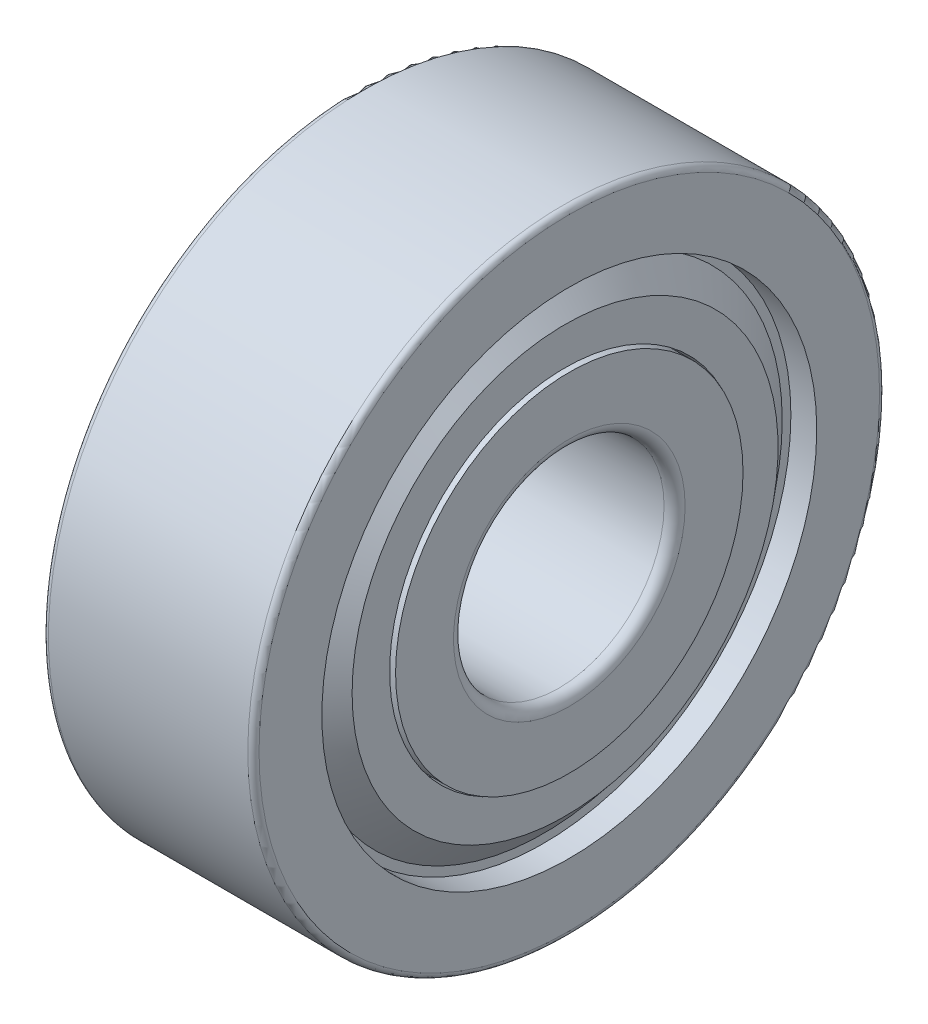
ISO-10303-21;
HEADER;
FILE_DESCRIPTION(('STEP AP214'),'2;1');
FILE_NAME('part.step','',(''),(''),'','','');
FILE_SCHEMA(('AUTOMOTIVE_DESIGN { 1 0 10303 214 1 1 1 1 }'));
ENDSEC;
DATA;
#1=APPLICATION_CONTEXT('core data for automotive mechanical design processes');
#2=APPLICATION_PROTOCOL_DEFINITION('international standard','automotive_design',2000,#1);
#3=PRODUCT_CONTEXT('',#1,'mechanical');
#4=PRODUCT('Part','Part','',(#3));
#5=PRODUCT_RELATED_PRODUCT_CATEGORY('part','',(#4));
#6=PRODUCT_DEFINITION_FORMATION('','',#4);
#7=PRODUCT_DEFINITION_CONTEXT('part definition',#1,'design');
#8=PRODUCT_DEFINITION('design','',#6,#7);
#9=PRODUCT_DEFINITION_SHAPE('','',#8);
#10=(LENGTH_UNIT() NAMED_UNIT(*) SI_UNIT(.MILLI.,.METRE.));
#11=(NAMED_UNIT(*) PLANE_ANGLE_UNIT() SI_UNIT($,.RADIAN.));
#12=(NAMED_UNIT(*) SI_UNIT($,.STERADIAN.) SOLID_ANGLE_UNIT());
#13=UNCERTAINTY_MEASURE_WITH_UNIT(LENGTH_MEASURE(1.E-05),#10,'distance_accuracy_value','');
#14=(GEOMETRIC_REPRESENTATION_CONTEXT(3) GLOBAL_UNCERTAINTY_ASSIGNED_CONTEXT((#13)) GLOBAL_UNIT_ASSIGNED_CONTEXT((#10,
#11,#12)) REPRESENTATION_CONTEXT('',''));
#15=CARTESIAN_POINT('',(0.,0.,0.));
#16=DIRECTION('',(0.,0.,1.));
#17=DIRECTION('',(1.,0.,0.));
#18=AXIS2_PLACEMENT_3D('',#15,#16,#17);
#19=CARTESIAN_POINT('',(0.,-9.525,0.));
#20=DIRECTION('',(1.,0.,0.));
#21=DIRECTION('',(0.,1.,0.));
#22=AXIS2_PLACEMENT_3D('',#19,#20,#21);
#23=SPHERICAL_SURFACE('',#22,2.38125);
#24=CARTESIAN_POINT('',(2.38125,-9.525,0.));
#25=VERTEX_POINT('',#24);
#26=VERTEX_LOOP('',#25);
#27=FACE_BOUND('',#26,.T.);
#28=CARTESIAN_POINT('',(-2.38125,-9.525,0.));
#29=VERTEX_POINT('',#28);
#30=VERTEX_LOOP('',#29);
#31=FACE_BOUND('',#30,.T.);
#32=ADVANCED_FACE('P0_F15',(#27,#31),#23,.T.);
#33=CLOSED_SHELL('',(#32));
#34=MANIFOLD_SOLID_BREP('P0_B1',#33);
#35=CARTESIAN_POINT('',(0.,0.,0.));
#36=DIRECTION('',(1.,0.,0.));
#37=DIRECTION('',(0.,0.,-1.));
#38=AXIS2_PLACEMENT_3D('',#35,#36,#37);
#39=TOROIDAL_SURFACE('',#38,9.525,2.38125);
#40=CARTESIAN_POINT('',(1.70055264454679,0.,0.));
#41=DIRECTION('',(1.,0.,0.));
#42=DIRECTION('',(0.,0.,-1.));
#43=AXIS2_PLACEMENT_3D('',#40,#41,#42);
#44=CIRCLE('',#43,11.191875);
#45=CARTESIAN_POINT('',(1.70055264454679,0.,-11.191875));
#46=VERTEX_POINT('',#45);
#47=EDGE_CURVE('P1_E197',#46,#46,#44,.T.);
#48=ORIENTED_EDGE('',*,*,#47,.T.);
#49=EDGE_LOOP('',(#48));
#50=FACE_BOUND('',#49,.T.);
#51=CARTESIAN_POINT('',(-1.70055264454679,0.,0.));
#52=DIRECTION('',(1.,0.,0.));
#53=DIRECTION('',(0.,0.,-1.));
#54=AXIS2_PLACEMENT_3D('',#51,#52,#53);
#55=CIRCLE('',#54,11.191875);
#56=CARTESIAN_POINT('',(-1.70055264454679,0.,-11.191875));
#57=VERTEX_POINT('',#56);
#58=EDGE_CURVE('P1_E201',#57,#57,#55,.F.);
#59=ORIENTED_EDGE('',*,*,#58,.T.);
#60=EDGE_LOOP('',(#59));
#61=FACE_BOUND('',#60,.T.);
#62=ADVANCED_FACE('P1_F14',(#50,#61),#39,.F.);
#63=CARTESIAN_POINT('',(-5.23875,0.,0.));
#64=DIRECTION('',(1.,0.,0.));
#65=DIRECTION('',(0.,0.,-1.));
#66=AXIS2_PLACEMENT_3D('',#63,#64,#65);
#67=CYLINDRICAL_SURFACE('',#66,11.191875);
#68=ORIENTED_EDGE('',*,*,#58,.F.);
#69=EDGE_LOOP('',(#68));
#70=FACE_BOUND('',#69,.T.);
#71=CARTESIAN_POINT('',(-3.35513474719232,0.,0.));
#72=DIRECTION('',(1.,0.,0.));
#73=DIRECTION('',(0.,0.,-1.));
#74=AXIS2_PLACEMENT_3D('',#71,#72,#73);
#75=CIRCLE('',#74,11.191875);
#76=CARTESIAN_POINT('',(-3.35513474719232,0.,-11.191875));
#77=VERTEX_POINT('',#76);
#78=EDGE_CURVE('P1_E18',#77,#77,#75,.T.);
#79=ORIENTED_EDGE('',*,*,#78,.F.);
#80=EDGE_LOOP('',(#79));
#81=FACE_BOUND('',#80,.T.);
#82=ADVANCED_FACE('P1_F133',(#70,#81),#67,.F.);
#83=CARTESIAN_POINT('',(-5.23875,0.,0.));
#84=DIRECTION('',(1.,0.,0.));
#85=DIRECTION('',(0.,0.,-1.));
#86=AXIS2_PLACEMENT_3D('',#83,#84,#85);
#87=CYLINDRICAL_SURFACE('',#86,11.191875);
#88=ORIENTED_EDGE('',*,*,#47,.F.);
#89=EDGE_LOOP('',(#88));
#90=FACE_BOUND('',#89,.T.);
#91=CARTESIAN_POINT('',(3.35513474719232,0.,0.));
#92=DIRECTION('',(1.,0.,0.));
#93=DIRECTION('',(0.,0.,-1.));
#94=AXIS2_PLACEMENT_3D('',#91,#92,#93);
#95=CIRCLE('',#94,11.191875);
#96=CARTESIAN_POINT('',(3.35513474719232,0.,-11.191875));
#97=VERTEX_POINT('',#96);
#98=EDGE_CURVE('P1_E192',#97,#97,#95,.T.);
#99=ORIENTED_EDGE('',*,*,#98,.T.);
#100=EDGE_LOOP('',(#99));
#101=FACE_BOUND('',#100,.T.);
#102=ADVANCED_FACE('P1_F130',(#90,#101),#87,.F.);
#103=CARTESIAN_POINT('',(-3.35513474719232,0.,0.));
#104=DIRECTION('',(1.,0.,0.));
#105=DIRECTION('',(0.,0.,-1.));
#106=AXIS2_PLACEMENT_3D('',#103,#104,#105);
#107=PLANE('',#106);
#108=CARTESIAN_POINT('',(-3.35513474719232,0.,0.));
#109=DIRECTION('',(1.,0.,0.));
#110=DIRECTION('',(0.,0.,-1.));
#111=AXIS2_PLACEMENT_3D('',#108,#109,#110);
#112=CIRCLE('',#111,7.93670625);
#113=CARTESIAN_POINT('',(-3.35513474719232,0.,-7.93670625));
#114=VERTEX_POINT('',#113);
#115=EDGE_CURVE('P1_E190',#114,#114,#112,.F.);
#116=ORIENTED_EDGE('',*,*,#115,.T.);
#117=EDGE_LOOP('',(#116));
#118=FACE_BOUND('',#117,.T.);
#119=ORIENTED_EDGE('',*,*,#78,.T.);
#120=EDGE_LOOP('',(#119));
#121=FACE_BOUND('',#120,.T.);
#122=ADVANCED_FACE('P1_F126',(#118,#121),#107,.T.);
#123=CARTESIAN_POINT('',(3.35513474719232,0.,0.));
#124=DIRECTION('',(1.,0.,0.));
#125=DIRECTION('',(0.,0.,-1.));
#126=AXIS2_PLACEMENT_3D('',#123,#124,#125);
#127=PLANE('',#126);
#128=CARTESIAN_POINT('',(3.35513474719232,0.,0.));
#129=DIRECTION('',(1.,0.,0.));
#130=DIRECTION('',(0.,0.,-1.));
#131=AXIS2_PLACEMENT_3D('',#128,#129,#130);
#132=CIRCLE('',#131,7.93670625);
#133=CARTESIAN_POINT('',(3.35513474719232,0.,-7.93670625));
#134=VERTEX_POINT('',#133);
#135=EDGE_CURVE('P1_E187',#134,#134,#132,.T.);
#136=ORIENTED_EDGE('',*,*,#135,.T.);
#137=EDGE_LOOP('',(#136));
#138=FACE_BOUND('',#137,.T.);
#139=ORIENTED_EDGE('',*,*,#98,.F.);
#140=EDGE_LOOP('',(#139));
#141=FACE_BOUND('',#140,.T.);
#142=ADVANCED_FACE('P1_F122',(#138,#141),#127,.F.);
#143=CARTESIAN_POINT('',(-5.0292,0.,0.));
#144=DIRECTION('',(1.,0.,0.));
#145=DIRECTION('',(0.,0.,-1.));
#146=AXIS2_PLACEMENT_3D('',#143,#144,#145);
#147=CYLINDRICAL_SURFACE('',#146,7.93670625);
#148=ORIENTED_EDGE('',*,*,#115,.F.);
#149=EDGE_LOOP('',(#148));
#150=FACE_BOUND('',#149,.T.);
#151=CARTESIAN_POINT('',(-4.572,0.,0.));
#152=DIRECTION('',(1.,0.,0.));
#153=DIRECTION('',(0.,0.,-1.));
#154=AXIS2_PLACEMENT_3D('',#151,#152,#153);
#155=CIRCLE('',#154,7.93670625);
#156=CARTESIAN_POINT('',(-4.572,0.,-7.93670625));
#157=VERTEX_POINT('',#156);
#158=EDGE_CURVE('P1_E184',#157,#157,#155,.F.);
#159=ORIENTED_EDGE('',*,*,#158,.T.);
#160=EDGE_LOOP('',(#159));
#161=FACE_BOUND('',#160,.T.);
#162=ADVANCED_FACE('P1_F118',(#150,#161),#147,.F.);
#163=CARTESIAN_POINT('',(-5.0292,0.,0.));
#164=DIRECTION('',(1.,0.,0.));
#165=DIRECTION('',(0.,0.,-1.));
#166=AXIS2_PLACEMENT_3D('',#163,#164,#165);
#167=CYLINDRICAL_SURFACE('',#166,7.93670625);
#168=CARTESIAN_POINT('',(4.572,0.,0.));
#169=DIRECTION('',(1.,0.,0.));
#170=DIRECTION('',(0.,0.,-1.));
#171=AXIS2_PLACEMENT_3D('',#168,#169,#170);
#172=CIRCLE('',#171,7.93670625);
#173=CARTESIAN_POINT('',(4.572,0.,-7.93670625));
#174=VERTEX_POINT('',#173);
#175=EDGE_CURVE('P1_E181',#174,#174,#172,.F.);
#176=ORIENTED_EDGE('',*,*,#175,.F.);
#177=EDGE_LOOP('',(#176));
#178=FACE_BOUND('',#177,.T.);
#179=ORIENTED_EDGE('',*,*,#135,.F.);
#180=EDGE_LOOP('',(#179));
#181=FACE_BOUND('',#180,.T.);
#182=ADVANCED_FACE('P1_F114',(#178,#181),#167,.F.);
#183=CARTESIAN_POINT('',(-4.572,0.,0.));
#184=DIRECTION('',(1.,0.,0.));
#185=DIRECTION('',(0.,0.,-1.));
#186=AXIS2_PLACEMENT_3D('',#183,#184,#185);
#187=PLANE('',#186);
#188=ORIENTED_EDGE('',*,*,#158,.F.);
#189=EDGE_LOOP('',(#188));
#190=FACE_BOUND('',#189,.T.);
#191=CARTESIAN_POINT('',(-4.57200001572153,0.,0.));
#192=DIRECTION('',(1.,0.,0.));
#193=DIRECTION('',(0.,0.,-1.));
#194=AXIS2_PLACEMENT_3D('',#191,#192,#193);
#195=CIRCLE('',#194,9.63374217569193);
#196=CARTESIAN_POINT('',(-4.57200001572153,0.,-9.63374217569193));
#197=VERTEX_POINT('',#196);
#198=EDGE_CURVE('P1_E178',#197,#197,#195,.T.);
#199=ORIENTED_EDGE('',*,*,#198,.F.);
#200=EDGE_LOOP('',(#199));
#201=FACE_BOUND('',#200,.T.);
#202=ADVANCED_FACE('P1_F110',(#190,#201),#187,.F.);
#203=CARTESIAN_POINT('',(4.572,0.,0.));
#204=DIRECTION('',(1.,0.,0.));
#205=DIRECTION('',(0.,0.,-1.));
#206=AXIS2_PLACEMENT_3D('',#203,#204,#205);
#207=PLANE('',#206);
#208=ORIENTED_EDGE('',*,*,#175,.T.);
#209=EDGE_LOOP('',(#208));
#210=FACE_BOUND('',#209,.T.);
#211=CARTESIAN_POINT('',(4.57200001572153,0.,0.));
#212=DIRECTION('',(-1.,0.,0.));
#213=DIRECTION('',(0.,0.,1.));
#214=AXIS2_PLACEMENT_3D('',#211,#212,#213);
#215=CIRCLE('',#214,9.63374217569193);
#216=CARTESIAN_POINT('',(4.57200001572153,0.,9.63374217569193));
#217=VERTEX_POINT('',#216);
#218=EDGE_CURVE('P1_E175',#217,#217,#215,.T.);
#219=ORIENTED_EDGE('',*,*,#218,.F.);
#220=EDGE_LOOP('',(#219));
#221=FACE_BOUND('',#220,.T.);
#222=ADVANCED_FACE('P1_F106',(#210,#221),#207,.T.);
#223=CARTESIAN_POINT('',(-3.5932597617508,0.,0.));
#224=DIRECTION('',(1.,0.,0.));
#225=DIRECTION('',(0.,0.,-1.));
#226=AXIS2_PLACEMENT_3D('',#223,#224,#225);
#227=CONICAL_SURFACE('',#226,10.800159387216,0.872664625);
#228=ORIENTED_EDGE('',*,*,#198,.T.);
#229=EDGE_LOOP('',(#228));
#230=FACE_BOUND('',#229,.T.);
#231=CARTESIAN_POINT('',(-3.5932597617508,0.,0.));
#232=DIRECTION('',(1.,0.,0.));
#233=DIRECTION('',(0.,0.,-1.));
#234=AXIS2_PLACEMENT_3D('',#231,#232,#233);
#235=CIRCLE('',#234,10.800159387216);
#236=CARTESIAN_POINT('',(-3.5932597617508,0.,-10.800159387216));
#237=VERTEX_POINT('',#236);
#238=EDGE_CURVE('P1_E172',#237,#237,#235,.F.);
#239=ORIENTED_EDGE('',*,*,#238,.T.);
#240=EDGE_LOOP('',(#239));
#241=FACE_BOUND('',#240,.T.);
#242=ADVANCED_FACE('P1_F102',(#230,#241),#227,.T.);
#243=CARTESIAN_POINT('',(3.5932597617508,0.,0.));
#244=DIRECTION('',(-1.,0.,0.));
#245=DIRECTION('',(0.,0.,1.));
#246=AXIS2_PLACEMENT_3D('',#243,#244,#245);
#247=CONICAL_SURFACE('',#246,10.800159387216,0.872664625);
#248=CARTESIAN_POINT('',(3.5932597617508,0.,0.));
#249=DIRECTION('',(-1.,0.,0.));
#250=DIRECTION('',(0.,0.,1.));
#251=AXIS2_PLACEMENT_3D('',#248,#249,#250);
#252=CIRCLE('',#251,10.800159387216);
#253=CARTESIAN_POINT('',(3.5932597617508,0.,10.800159387216));
#254=VERTEX_POINT('',#253);
#255=EDGE_CURVE('P1_E169',#254,#254,#252,.T.);
#256=ORIENTED_EDGE('',*,*,#255,.F.);
#257=EDGE_LOOP('',(#256));
#258=FACE_BOUND('',#257,.T.);
#259=ORIENTED_EDGE('',*,*,#218,.T.);
#260=EDGE_LOOP('',(#259));
#261=FACE_BOUND('',#260,.T.);
#262=ADVANCED_FACE('P1_F98',(#258,#261),#247,.T.);
#263=CARTESIAN_POINT('',(-3.59325974719232,0.,0.));
#264=DIRECTION('',(1.,0.,0.));
#265=DIRECTION('',(0.,0.,-1.));
#266=AXIS2_PLACEMENT_3D('',#263,#264,#265);
#267=PLANE('',#266);
#268=ORIENTED_EDGE('',*,*,#238,.F.);
#269=EDGE_LOOP('',(#268));
#270=FACE_BOUND('',#269,.T.);
#271=CARTESIAN_POINT('',(-3.59325974719232,0.,0.));
#272=DIRECTION('',(1.,0.,0.));
#273=DIRECTION('',(0.,0.,-1.));
#274=AXIS2_PLACEMENT_3D('',#271,#272,#273);
#275=CIRCLE('',#274,11.191875);
#276=CARTESIAN_POINT('',(-3.59325974719232,0.,-11.191875));
#277=VERTEX_POINT('',#276);
#278=EDGE_CURVE('P1_E166',#277,#277,#275,.F.);
#279=ORIENTED_EDGE('',*,*,#278,.T.);
#280=EDGE_LOOP('',(#279));
#281=FACE_BOUND('',#280,.T.);
#282=ADVANCED_FACE('P1_F94',(#270,#281),#267,.F.);
#283=CARTESIAN_POINT('',(3.59325974719232,0.,0.));
#284=DIRECTION('',(1.,0.,0.));
#285=DIRECTION('',(0.,0.,-1.));
#286=AXIS2_PLACEMENT_3D('',#283,#284,#285);
#287=PLANE('',#286);
#288=ORIENTED_EDGE('',*,*,#255,.T.);
#289=EDGE_LOOP('',(#288));
#290=FACE_BOUND('',#289,.T.);
#291=CARTESIAN_POINT('',(3.59325974719232,0.,0.));
#292=DIRECTION('',(1.,0.,0.));
#293=DIRECTION('',(0.,0.,-1.));
#294=AXIS2_PLACEMENT_3D('',#291,#292,#293);
#295=CIRCLE('',#294,11.191875);
#296=CARTESIAN_POINT('',(3.59325974719232,0.,-11.191875));
#297=VERTEX_POINT('',#296);
#298=EDGE_CURVE('P1_E159',#297,#297,#295,.T.);
#299=ORIENTED_EDGE('',*,*,#298,.T.);
#300=EDGE_LOOP('',(#299));
#301=FACE_BOUND('',#300,.T.);
#302=ADVANCED_FACE('P1_F90',(#290,#301),#287,.T.);
#303=CARTESIAN_POINT('',(-5.23875,0.,0.));
#304=DIRECTION('',(1.,0.,0.));
#305=DIRECTION('',(0.,0.,-1.));
#306=AXIS2_PLACEMENT_3D('',#303,#304,#305);
#307=CYLINDRICAL_SURFACE('',#306,11.191875);
#308=CARTESIAN_POINT('',(-4.7625,0.,0.));
#309=DIRECTION('',(1.,0.,0.));
#310=DIRECTION('',(0.,0.,-1.));
#311=AXIS2_PLACEMENT_3D('',#308,#309,#310);
#312=CIRCLE('',#311,11.191875);
#313=CARTESIAN_POINT('',(-4.7625,0.,-11.191875));
#314=VERTEX_POINT('',#313);
#315=EDGE_CURVE('P1_E154',#314,#314,#312,.F.);
#316=ORIENTED_EDGE('',*,*,#315,.T.);
#317=EDGE_LOOP('',(#316));
#318=FACE_BOUND('',#317,.T.);
#319=ORIENTED_EDGE('',*,*,#278,.F.);
#320=EDGE_LOOP('',(#319));
#321=FACE_BOUND('',#320,.T.);
#322=ADVANCED_FACE('P1_F86',(#318,#321),#307,.F.);
#323=CARTESIAN_POINT('',(-5.23875,0.,0.));
#324=DIRECTION('',(1.,0.,0.));
#325=DIRECTION('',(0.,0.,-1.));
#326=AXIS2_PLACEMENT_3D('',#323,#324,#325);
#327=CYLINDRICAL_SURFACE('',#326,11.191875);
#328=CARTESIAN_POINT('',(4.7625,0.,0.));
#329=DIRECTION('',(1.,0.,0.));
#330=DIRECTION('',(0.,0.,-1.));
#331=AXIS2_PLACEMENT_3D('',#328,#329,#330);
#332=CIRCLE('',#331,11.191875);
#333=CARTESIAN_POINT('',(4.7625,0.,-11.191875));
#334=VERTEX_POINT('',#333);
#335=EDGE_CURVE('P1_E152',#334,#334,#332,.F.);
#336=ORIENTED_EDGE('',*,*,#335,.F.);
#337=EDGE_LOOP('',(#336));
#338=FACE_BOUND('',#337,.T.);
#339=ORIENTED_EDGE('',*,*,#298,.F.);
#340=EDGE_LOOP('',(#339));
#341=FACE_BOUND('',#340,.T.);
#342=ADVANCED_FACE('P1_F81',(#338,#341),#327,.F.);
#343=CARTESIAN_POINT('',(-4.7625,0.,0.));
#344=DIRECTION('',(1.,0.,0.));
#345=DIRECTION('',(0.,0.,-1.));
#346=AXIS2_PLACEMENT_3D('',#343,#344,#345);
#347=PLANE('',#346);
#348=ORIENTED_EDGE('',*,*,#315,.F.);
#349=EDGE_LOOP('',(#348));
#350=FACE_BOUND('',#349,.T.);
#351=CARTESIAN_POINT('',(-4.7625,0.,0.));
#352=DIRECTION('',(1.,0.,0.));
#353=DIRECTION('',(0.,0.,1.));
#354=AXIS2_PLACEMENT_3D('',#351,#352,#353);
#355=CIRCLE('',#354,14.0335);
#356=CARTESIAN_POINT('',(-4.7625,0.,14.0335));
#357=VERTEX_POINT('',#356);
#358=EDGE_CURVE('P1_E65',#357,#357,#355,.T.);
#359=ORIENTED_EDGE('',*,*,#358,.F.);
#360=EDGE_LOOP('',(#359));
#361=FACE_BOUND('',#360,.T.);
#362=ADVANCED_FACE('P1_F71',(#350,#361),#347,.F.);
#363=CARTESIAN_POINT('',(4.7625,0.,0.));
#364=DIRECTION('',(1.,0.,0.));
#365=DIRECTION('',(0.,0.,-1.));
#366=AXIS2_PLACEMENT_3D('',#363,#364,#365);
#367=PLANE('',#366);
#368=ORIENTED_EDGE('',*,*,#335,.T.);
#369=EDGE_LOOP('',(#368));
#370=FACE_BOUND('',#369,.T.);
#371=CARTESIAN_POINT('',(4.7625,0.,0.));
#372=DIRECTION('',(-1.,0.,0.));
#373=DIRECTION('',(0.,0.,1.));
#374=AXIS2_PLACEMENT_3D('',#371,#372,#373);
#375=CIRCLE('',#374,14.0335);
#376=CARTESIAN_POINT('',(4.7625,0.,14.0335));
#377=VERTEX_POINT('',#376);
#378=EDGE_CURVE('P1_E27',#377,#377,#375,.T.);
#379=ORIENTED_EDGE('',*,*,#378,.F.);
#380=EDGE_LOOP('',(#379));
#381=FACE_BOUND('',#380,.T.);
#382=ADVANCED_FACE('P1_F80',(#370,#381),#367,.T.);
#383=CARTESIAN_POINT('',(-4.5085,0.,0.));
#384=DIRECTION('',(1.,0.,0.));
#385=DIRECTION('',(0.,0.,-1.));
#386=AXIS2_PLACEMENT_3D('',#383,#384,#385);
#387=TOROIDAL_SURFACE('',#386,14.0335,0.254);
#388=CARTESIAN_POINT('',(-4.5085,0.,0.));
#389=DIRECTION('',(1.,0.,0.));
#390=DIRECTION('',(0.,0.,-1.));
#391=AXIS2_PLACEMENT_3D('',#388,#389,#390);
#392=CIRCLE('',#391,14.2875);
#393=CARTESIAN_POINT('',(-4.5085,0.,-14.2875));
#394=VERTEX_POINT('',#393);
#395=EDGE_CURVE('P1_E22',#394,#394,#392,.T.);
#396=ORIENTED_EDGE('',*,*,#395,.F.);
#397=EDGE_LOOP('',(#396));
#398=FACE_BOUND('',#397,.T.);
#399=ORIENTED_EDGE('',*,*,#358,.T.);
#400=EDGE_LOOP('',(#399));
#401=FACE_BOUND('',#400,.T.);
#402=ADVANCED_FACE('P1_F45',(#398,#401),#387,.T.);
#403=CARTESIAN_POINT('',(4.5085,0.,0.));
#404=DIRECTION('',(-1.,0.,0.));
#405=DIRECTION('',(0.,0.,1.));
#406=AXIS2_PLACEMENT_3D('',#403,#404,#405);
#407=TOROIDAL_SURFACE('',#406,14.0335,0.254);
#408=CARTESIAN_POINT('',(4.5085,0.,0.));
#409=DIRECTION('',(1.,0.,0.));
#410=DIRECTION('',(0.,0.,-1.));
#411=AXIS2_PLACEMENT_3D('',#408,#409,#410);
#412=CIRCLE('',#411,14.2875);
#413=CARTESIAN_POINT('',(4.5085,0.,-14.2875));
#414=VERTEX_POINT('',#413);
#415=EDGE_CURVE('P1_E10',#414,#414,#412,.F.);
#416=ORIENTED_EDGE('',*,*,#415,.F.);
#417=EDGE_LOOP('',(#416));
#418=FACE_BOUND('',#417,.T.);
#419=ORIENTED_EDGE('',*,*,#378,.T.);
#420=EDGE_LOOP('',(#419));
#421=FACE_BOUND('',#420,.T.);
#422=ADVANCED_FACE('P1_F39',(#418,#421),#407,.T.);
#423=CARTESIAN_POINT('',(-5.23875,0.,0.));
#424=DIRECTION('',(1.,0.,0.));
#425=DIRECTION('',(0.,0.,-1.));
#426=AXIS2_PLACEMENT_3D('',#423,#424,#425);
#427=CYLINDRICAL_SURFACE('',#426,14.2875);
#428=ORIENTED_EDGE('',*,*,#415,.T.);
#429=EDGE_LOOP('',(#428));
#430=FACE_BOUND('',#429,.T.);
#431=ORIENTED_EDGE('',*,*,#395,.T.);
#432=EDGE_LOOP('',(#431));
#433=FACE_BOUND('',#432,.T.);
#434=ADVANCED_FACE('P1_F44',(#430,#433),#427,.T.);
#435=CLOSED_SHELL('',(#62,#82,#102,#122,#142,#162,#182,#202,#222,#242,#262,#282,#302,#322,#342,
#362,#382,#402,#422,#434));
#436=MANIFOLD_SOLID_BREP('P1_B1',#435);
#437=CARTESIAN_POINT('',(0.,9.525,0.));
#438=DIRECTION('',(1.,0.,0.));
#439=DIRECTION('',(0.,1.,0.));
#440=AXIS2_PLACEMENT_3D('',#437,#438,#439);
#441=SPHERICAL_SURFACE('',#440,2.38125);
#442=CARTESIAN_POINT('',(2.38125,9.525,0.));
#443=VERTEX_POINT('',#442);
#444=VERTEX_LOOP('',#443);
#445=FACE_BOUND('',#444,.T.);
#446=CARTESIAN_POINT('',(-2.38125,9.525,0.));
#447=VERTEX_POINT('',#446);
#448=VERTEX_LOOP('',#447);
#449=FACE_BOUND('',#448,.T.);
#450=ADVANCED_FACE('P2_F15',(#445,#449),#441,.T.);
#451=CLOSED_SHELL('',(#450));
#452=MANIFOLD_SOLID_BREP('P2_B1',#451);
#453=CARTESIAN_POINT('',(0.,-6.735192090803,6.735192090803));
#454=DIRECTION('',(1.,0.,0.));
#455=DIRECTION('',(0.,1.,0.));
#456=AXIS2_PLACEMENT_3D('',#453,#454,#455);
#457=SPHERICAL_SURFACE('',#456,2.38125);
#458=CARTESIAN_POINT('',(2.38125,-6.735192090803,6.735192090803));
#459=VERTEX_POINT('',#458);
#460=VERTEX_LOOP('',#459);
#461=FACE_BOUND('',#460,.T.);
#462=CARTESIAN_POINT('',(-2.38125,-6.735192090803,6.735192090803));
#463=VERTEX_POINT('',#462);
#464=VERTEX_LOOP('',#463);
#465=FACE_BOUND('',#464,.T.);
#466=ADVANCED_FACE('P3_F15',(#461,#465),#457,.T.);
#467=CLOSED_SHELL('',(#466));
#468=MANIFOLD_SOLID_BREP('P3_B1',#467);
#469=CARTESIAN_POINT('',(0.,0.,-9.525));
#470=DIRECTION('',(1.,0.,0.));
#471=DIRECTION('',(0.,1.,0.));
#472=AXIS2_PLACEMENT_3D('',#469,#470,#471);
#473=SPHERICAL_SURFACE('',#472,2.38125);
#474=CARTESIAN_POINT('',(2.38125,0.,-9.525));
#475=VERTEX_POINT('',#474);
#476=VERTEX_LOOP('',#475);
#477=FACE_BOUND('',#476,.T.);
#478=CARTESIAN_POINT('',(-2.38125,0.,-9.525));
#479=VERTEX_POINT('',#478);
#480=VERTEX_LOOP('',#479);
#481=FACE_BOUND('',#480,.T.);
#482=ADVANCED_FACE('P4_F15',(#477,#481),#473,.T.);
#483=CLOSED_SHELL('',(#482));
#484=MANIFOLD_SOLID_BREP('P4_B1',#483);
#485=CARTESIAN_POINT('',(0.,0.,9.525));
#486=DIRECTION('',(1.,0.,0.));
#487=DIRECTION('',(0.,1.,0.));
#488=AXIS2_PLACEMENT_3D('',#485,#486,#487);
#489=SPHERICAL_SURFACE('',#488,2.38125);
#490=CARTESIAN_POINT('',(2.38125,0.,9.525));
#491=VERTEX_POINT('',#490);
#492=VERTEX_LOOP('',#491);
#493=FACE_BOUND('',#492,.T.);
#494=CARTESIAN_POINT('',(-2.38125,0.,9.525));
#495=VERTEX_POINT('',#494);
#496=VERTEX_LOOP('',#495);
#497=FACE_BOUND('',#496,.T.);
#498=ADVANCED_FACE('P5_F15',(#493,#497),#489,.T.);
#499=CLOSED_SHELL('',(#498));
#500=MANIFOLD_SOLID_BREP('P5_B1',#499);
#501=CARTESIAN_POINT('',(0.,-6.735192090803,-6.735192090803));
#502=DIRECTION('',(1.,0.,0.));
#503=DIRECTION('',(0.,1.,0.));
#504=AXIS2_PLACEMENT_3D('',#501,#502,#503);
#505=SPHERICAL_SURFACE('',#504,2.38125);
#506=CARTESIAN_POINT('',(2.38125,-6.735192090803,-6.735192090803));
#507=VERTEX_POINT('',#506);
#508=VERTEX_LOOP('',#507);
#509=FACE_BOUND('',#508,.T.);
#510=CARTESIAN_POINT('',(-2.38125,-6.735192090803,-6.735192090803));
#511=VERTEX_POINT('',#510);
#512=VERTEX_LOOP('',#511);
#513=FACE_BOUND('',#512,.T.);
#514=ADVANCED_FACE('P6_F15',(#509,#513),#505,.T.);
#515=CLOSED_SHELL('',(#514));
#516=MANIFOLD_SOLID_BREP('P6_B1',#515);
#517=CARTESIAN_POINT('',(0.,6.735192090803,-6.735192090803));
#518=DIRECTION('',(1.,0.,0.));
#519=DIRECTION('',(0.,1.,0.));
#520=AXIS2_PLACEMENT_3D('',#517,#518,#519);
#521=SPHERICAL_SURFACE('',#520,2.38125);
#522=CARTESIAN_POINT('',(2.38125,6.735192090803,-6.735192090803));
#523=VERTEX_POINT('',#522);
#524=VERTEX_LOOP('',#523);
#525=FACE_BOUND('',#524,.T.);
#526=CARTESIAN_POINT('',(-2.38125,6.735192090803,-6.735192090803));
#527=VERTEX_POINT('',#526);
#528=VERTEX_LOOP('',#527);
#529=FACE_BOUND('',#528,.T.);
#530=ADVANCED_FACE('P7_F15',(#525,#529),#521,.T.);
#531=CLOSED_SHELL('',(#530));
#532=MANIFOLD_SOLID_BREP('P7_B1',#531);
#533=CARTESIAN_POINT('',(0.,0.,0.));
#534=DIRECTION('',(1.,0.,0.));
#535=DIRECTION('',(0.,0.,-1.));
#536=AXIS2_PLACEMENT_3D('',#533,#534,#535);
#537=TOROIDAL_SURFACE('',#536,9.525,2.38125);
#538=CARTESIAN_POINT('',(-1.70055264454679,0.,0.));
#539=DIRECTION('',(1.,0.,0.));
#540=DIRECTION('',(0.,0.,-1.));
#541=AXIS2_PLACEMENT_3D('',#538,#539,#540);
#542=CIRCLE('',#541,7.858125);
#543=CARTESIAN_POINT('',(-1.70055264454679,0.,-7.858125));
#544=VERTEX_POINT('',#543);
#545=EDGE_CURVE('P8_E117',#544,#544,#542,.F.);
#546=ORIENTED_EDGE('',*,*,#545,.F.);
#547=EDGE_LOOP('',(#546));
#548=FACE_BOUND('',#547,.T.);
#549=CARTESIAN_POINT('',(1.70055264454679,0.,0.));
#550=DIRECTION('',(1.,0.,0.));
#551=DIRECTION('',(0.,0.,-1.));
#552=AXIS2_PLACEMENT_3D('',#549,#550,#551);
#553=CIRCLE('',#552,7.858125);
#554=CARTESIAN_POINT('',(1.70055264454679,0.,-7.858125));
#555=VERTEX_POINT('',#554);
#556=EDGE_CURVE('P8_E112',#555,#555,#553,.T.);
#557=ORIENTED_EDGE('',*,*,#556,.F.);
#558=EDGE_LOOP('',(#557));
#559=FACE_BOUND('',#558,.T.);
#560=ADVANCED_FACE('P8_F14',(#548,#559),#537,.F.);
#561=CARTESIAN_POINT('',(-5.23875,0.,0.));
#562=DIRECTION('',(1.,0.,0.));
#563=DIRECTION('',(0.,0.,-1.));
#564=AXIS2_PLACEMENT_3D('',#561,#562,#563);
#565=CYLINDRICAL_SURFACE('',#564,7.858125);
#566=ORIENTED_EDGE('',*,*,#545,.T.);
#567=EDGE_LOOP('',(#566));
#568=FACE_BOUND('',#567,.T.);
#569=CARTESIAN_POINT('',(-4.7625,0.,0.));
#570=DIRECTION('',(1.,0.,0.));
#571=DIRECTION('',(0.,0.,-1.));
#572=AXIS2_PLACEMENT_3D('',#569,#570,#571);
#573=CIRCLE('',#572,7.858125);
#574=CARTESIAN_POINT('',(-4.7625,0.,-7.858125));
#575=VERTEX_POINT('',#574);
#576=EDGE_CURVE('P8_E18',#575,#575,#573,.T.);
#577=ORIENTED_EDGE('',*,*,#576,.T.);
#578=EDGE_LOOP('',(#577));
#579=FACE_BOUND('',#578,.T.);
#580=ADVANCED_FACE('P8_F83',(#568,#579),#565,.T.);
#581=CARTESIAN_POINT('',(-5.23875,0.,0.));
#582=DIRECTION('',(1.,0.,0.));
#583=DIRECTION('',(0.,0.,-1.));
#584=AXIS2_PLACEMENT_3D('',#581,#582,#583);
#585=CYLINDRICAL_SURFACE('',#584,7.858125);
#586=CARTESIAN_POINT('',(4.7625,0.,0.));
#587=DIRECTION('',(1.,0.,0.));
#588=DIRECTION('',(0.,0.,-1.));
#589=AXIS2_PLACEMENT_3D('',#586,#587,#588);
#590=CIRCLE('',#589,7.858125);
#591=CARTESIAN_POINT('',(4.7625,0.,-7.858125));
#592=VERTEX_POINT('',#591);
#593=EDGE_CURVE('P8_E107',#592,#592,#590,.T.);
#594=ORIENTED_EDGE('',*,*,#593,.F.);
#595=EDGE_LOOP('',(#594));
#596=FACE_BOUND('',#595,.T.);
#597=ORIENTED_EDGE('',*,*,#556,.T.);
#598=EDGE_LOOP('',(#597));
#599=FACE_BOUND('',#598,.T.);
#600=ADVANCED_FACE('P8_F80',(#596,#599),#585,.T.);
#601=CARTESIAN_POINT('',(-4.7625,0.,0.));
#602=DIRECTION('',(1.,0.,0.));
#603=DIRECTION('',(0.,0.,-1.));
#604=AXIS2_PLACEMENT_3D('',#601,#602,#603);
#605=PLANE('',#604);
#606=CARTESIAN_POINT('',(-4.7625,0.,0.));
#607=DIRECTION('',(-1.,0.,0.));
#608=DIRECTION('',(0.,-1.,0.));
#609=AXIS2_PLACEMENT_3D('',#606,#607,#608);
#610=CIRCLE('',#609,5.23875);
#611=CARTESIAN_POINT('',(-4.7625,-5.23875,0.));
#612=VERTEX_POINT('',#611);
#613=EDGE_CURVE('P8_E64',#612,#612,#610,.T.);
#614=ORIENTED_EDGE('',*,*,#613,.F.);
#615=EDGE_LOOP('',(#614));
#616=FACE_BOUND('',#615,.T.);
#617=ORIENTED_EDGE('',*,*,#576,.F.);
#618=EDGE_LOOP('',(#617));
#619=FACE_BOUND('',#618,.T.);
#620=ADVANCED_FACE('P8_F70',(#616,#619),#605,.F.);
#621=CARTESIAN_POINT('',(4.7625,0.,0.));
#622=DIRECTION('',(1.,0.,0.));
#623=DIRECTION('',(0.,0.,-1.));
#624=AXIS2_PLACEMENT_3D('',#621,#622,#623);
#625=PLANE('',#624);
#626=CARTESIAN_POINT('',(4.7625,0.,0.));
#627=DIRECTION('',(1.,0.,0.));
#628=DIRECTION('',(0.,-1.,0.));
#629=AXIS2_PLACEMENT_3D('',#626,#627,#628);
#630=CIRCLE('',#629,5.23875);
#631=CARTESIAN_POINT('',(4.7625,-5.23875,0.));
#632=VERTEX_POINT('',#631);
#633=EDGE_CURVE('P8_E27',#632,#632,#630,.T.);
#634=ORIENTED_EDGE('',*,*,#633,.F.);
#635=EDGE_LOOP('',(#634));
#636=FACE_BOUND('',#635,.T.);
#637=ORIENTED_EDGE('',*,*,#593,.T.);
#638=EDGE_LOOP('',(#637));
#639=FACE_BOUND('',#638,.T.);
#640=ADVANCED_FACE('P8_F79',(#636,#639),#625,.T.);
#641=CARTESIAN_POINT('',(-4.28625,0.,0.));
#642=DIRECTION('',(1.,0.,0.));
#643=DIRECTION('',(0.,0.,-1.));
#644=AXIS2_PLACEMENT_3D('',#641,#642,#643);
#645=TOROIDAL_SURFACE('',#644,5.23875,0.47625);
#646=ORIENTED_EDGE('',*,*,#613,.T.);
#647=EDGE_LOOP('',(#646));
#648=FACE_BOUND('',#647,.T.);
#649=CARTESIAN_POINT('',(-4.28625,0.,0.));
#650=DIRECTION('',(1.,0.,0.));
#651=DIRECTION('',(0.,0.,-1.));
#652=AXIS2_PLACEMENT_3D('',#649,#650,#651);
#653=CIRCLE('',#652,4.7625);
#654=CARTESIAN_POINT('',(-4.28625,0.,-4.7625));
#655=VERTEX_POINT('',#654);
#656=EDGE_CURVE('P8_E22',#655,#655,#653,.T.);
#657=ORIENTED_EDGE('',*,*,#656,.T.);
#658=EDGE_LOOP('',(#657));
#659=FACE_BOUND('',#658,.T.);
#660=ADVANCED_FACE('P8_F45',(#648,#659),#645,.T.);
#661=CARTESIAN_POINT('',(4.28625,0.,0.));
#662=DIRECTION('',(1.,0.,0.));
#663=DIRECTION('',(0.,0.,-1.));
#664=AXIS2_PLACEMENT_3D('',#661,#662,#663);
#665=TOROIDAL_SURFACE('',#664,5.23875,0.47625);
#666=CARTESIAN_POINT('',(4.28625,0.,0.));
#667=DIRECTION('',(1.,0.,0.));
#668=DIRECTION('',(0.,0.,-1.));
#669=AXIS2_PLACEMENT_3D('',#666,#667,#668);
#670=CIRCLE('',#669,4.7625);
#671=CARTESIAN_POINT('',(4.28625,0.,-4.7625));
#672=VERTEX_POINT('',#671);
#673=EDGE_CURVE('P8_E10',#672,#672,#670,.F.);
#674=ORIENTED_EDGE('',*,*,#673,.T.);
#675=EDGE_LOOP('',(#674));
#676=FACE_BOUND('',#675,.T.);
#677=ORIENTED_EDGE('',*,*,#633,.T.);
#678=EDGE_LOOP('',(#677));
#679=FACE_BOUND('',#678,.T.);
#680=ADVANCED_FACE('P8_F39',(#676,#679),#665,.T.);
#681=CARTESIAN_POINT('',(-5.23875,0.,0.));
#682=DIRECTION('',(1.,0.,0.));
#683=DIRECTION('',(0.,0.,-1.));
#684=AXIS2_PLACEMENT_3D('',#681,#682,#683);
#685=CYLINDRICAL_SURFACE('',#684,4.7625);
#686=ORIENTED_EDGE('',*,*,#673,.F.);
#687=EDGE_LOOP('',(#686));
#688=FACE_BOUND('',#687,.T.);
#689=ORIENTED_EDGE('',*,*,#656,.F.);
#690=EDGE_LOOP('',(#689));
#691=FACE_BOUND('',#690,.T.);
#692=ADVANCED_FACE('P8_F44',(#688,#691),#685,.F.);
#693=CLOSED_SHELL('',(#560,#580,#600,#620,#640,#660,#680,#692));
#694=MANIFOLD_SOLID_BREP('P8_B1',#693);
#695=CARTESIAN_POINT('',(0.,6.735192090803,6.735192090803));
#696=DIRECTION('',(1.,0.,0.));
#697=DIRECTION('',(0.,1.,0.));
#698=AXIS2_PLACEMENT_3D('',#695,#696,#697);
#699=SPHERICAL_SURFACE('',#698,2.38125);
#700=CARTESIAN_POINT('',(2.38125,6.735192090803,6.735192090803));
#701=VERTEX_POINT('',#700);
#702=VERTEX_LOOP('',#701);
#703=FACE_BOUND('',#702,.T.);
#704=CARTESIAN_POINT('',(-2.38125,6.735192090803,6.735192090803));
#705=VERTEX_POINT('',#704);
#706=VERTEX_LOOP('',#705);
#707=FACE_BOUND('',#706,.T.);
#708=ADVANCED_FACE('P9_F14',(#703,#707),#699,.T.);
#709=CLOSED_SHELL('',(#708));
#710=MANIFOLD_SOLID_BREP('P9_B1',#709);
#711=ADVANCED_BREP_SHAPE_REPRESENTATION('',(#18,#34,#436,#452,#468,#484,#500,#516,#532,#694,
#710),#14);
#712=SHAPE_DEFINITION_REPRESENTATION(#9,#711);
ENDSEC;
END-ISO-10303-21;
